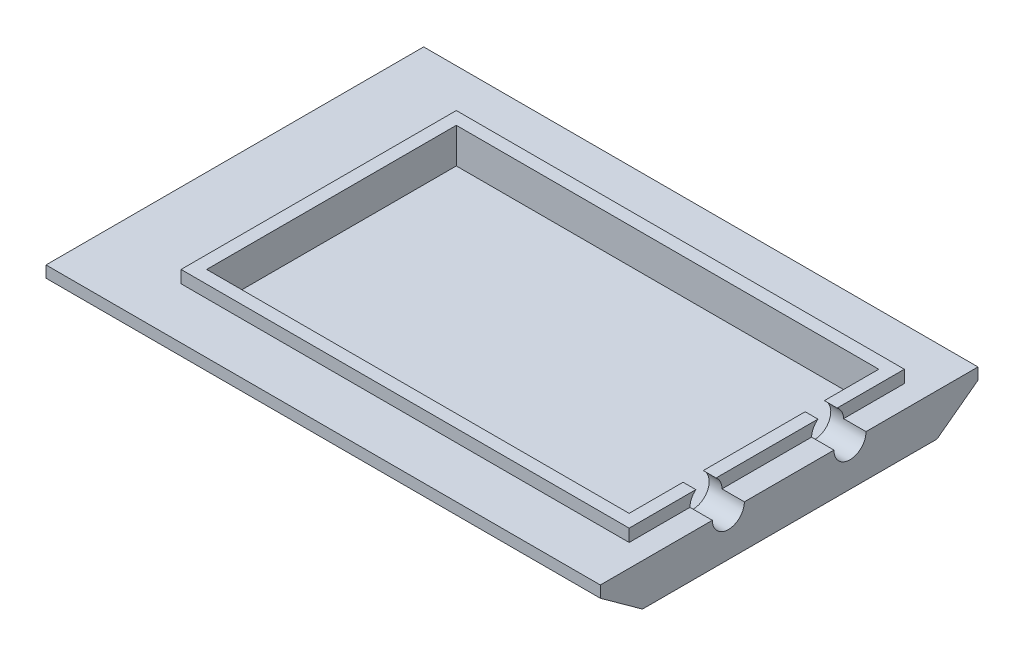
ISO-10303-21;
HEADER;
FILE_DESCRIPTION(('STEP AP214'),'2;1');
FILE_NAME('part.step','',(''),(''),'','','');
FILE_SCHEMA(('AUTOMOTIVE_DESIGN { 1 0 10303 214 1 1 1 1 }'));
ENDSEC;
DATA;
#1=APPLICATION_CONTEXT('core data for automotive mechanical design processes');
#2=APPLICATION_PROTOCOL_DEFINITION('international standard','automotive_design',2000,#1);
#3=PRODUCT_CONTEXT('',#1,'mechanical');
#4=PRODUCT('Part','Part','',(#3));
#5=PRODUCT_RELATED_PRODUCT_CATEGORY('part','',(#4));
#6=PRODUCT_DEFINITION_FORMATION('','',#4);
#7=PRODUCT_DEFINITION_CONTEXT('part definition',#1,'design');
#8=PRODUCT_DEFINITION('design','',#6,#7);
#9=PRODUCT_DEFINITION_SHAPE('','',#8);
#10=(LENGTH_UNIT() NAMED_UNIT(*) SI_UNIT(.MILLI.,.METRE.));
#11=(NAMED_UNIT(*) PLANE_ANGLE_UNIT() SI_UNIT($,.RADIAN.));
#12=(NAMED_UNIT(*) SI_UNIT($,.STERADIAN.) SOLID_ANGLE_UNIT());
#13=UNCERTAINTY_MEASURE_WITH_UNIT(LENGTH_MEASURE(1.E-05),#10,'distance_accuracy_value','');
#14=(GEOMETRIC_REPRESENTATION_CONTEXT(3) GLOBAL_UNCERTAINTY_ASSIGNED_CONTEXT((#13)) GLOBAL_UNIT_ASSIGNED_CONTEXT((#10,
#11,#12)) REPRESENTATION_CONTEXT('',''));
#15=CARTESIAN_POINT('',(0.,0.,0.));
#16=DIRECTION('',(0.,0.,1.));
#17=DIRECTION('',(1.,0.,0.));
#18=AXIS2_PLACEMENT_3D('',#15,#16,#17);
#19=CARTESIAN_POINT('',(0.,21.59,0.));
#20=DIRECTION('',(0.,1.,0.));
#21=DIRECTION('',(0.,0.,1.));
#22=AXIS2_PLACEMENT_3D('',#19,#20,#21);
#23=PLANE('',#22);
#24=DIRECTION('',(1.,0.,0.));
#25=VECTOR('',#24,1.);
#26=CARTESIAN_POINT('',(-19.05,21.59,86.7760235248049));
#27=LINE('',#26,#25);
#28=CARTESIAN_POINT('',(-13.97,21.59,86.7760235248049));
#29=VERTEX_POINT('',#28);
#30=CARTESIAN_POINT('',(-8.89,21.59,86.7760235248049));
#31=VERTEX_POINT('',#30);
#32=EDGE_CURVE('E480',#29,#31,#27,.T.);
#33=ORIENTED_EDGE('',*,*,#32,.F.);
#34=DIRECTION('',(0.,0.,-1.));
#35=VECTOR('',#34,1.);
#36=CARTESIAN_POINT('',(-13.97,21.59,9.11086956521744));
#37=LINE('',#36,#35);
#38=CARTESIAN_POINT('',(-13.97,21.59,108.170869565217));
#39=VERTEX_POINT('',#38);
#40=EDGE_CURVE('E483',#39,#29,#37,.T.);
#41=ORIENTED_EDGE('',*,*,#40,.F.);
#42=DIRECTION('',(1.,0.,0.));
#43=VECTOR('',#42,1.);
#44=CARTESIAN_POINT('',(-181.61,21.59,108.170869565217));
#45=LINE('',#44,#43);
#46=CARTESIAN_POINT('',(-181.61,21.59,108.170869565217));
#47=VERTEX_POINT('',#46);
#48=EDGE_CURVE('E505',#47,#39,#45,.T.);
#49=ORIENTED_EDGE('',*,*,#48,.F.);
#50=DIRECTION('',(0.,0.,1.));
#51=VECTOR('',#50,1.);
#52=CARTESIAN_POINT('',(-181.61,21.59,9.11086956521744));
#53=LINE('',#52,#51);
#54=CARTESIAN_POINT('',(-181.61,21.59,9.11086956521744));
#55=VERTEX_POINT('',#54);
#56=EDGE_CURVE('E509',#55,#47,#53,.T.);
#57=ORIENTED_EDGE('',*,*,#56,.F.);
#58=DIRECTION('',(-1.,0.,0.));
#59=VECTOR('',#58,1.);
#60=CARTESIAN_POINT('',(-181.61,21.59,9.11086956521744));
#61=LINE('',#60,#59);
#62=CARTESIAN_POINT('',(-13.97,21.59,9.11086956521744));
#63=VERTEX_POINT('',#62);
#64=EDGE_CURVE('E512',#63,#55,#61,.T.);
#65=ORIENTED_EDGE('',*,*,#64,.F.);
#66=CARTESIAN_POINT('',(-13.97,21.59,30.7008695652174));
#67=VERTEX_POINT('',#66);
#68=EDGE_CURVE('E499',#67,#63,#37,.T.);
#69=ORIENTED_EDGE('',*,*,#68,.F.);
#70=DIRECTION('',(1.,0.,0.));
#71=VECTOR('',#70,1.);
#72=CARTESIAN_POINT('',(-19.05,21.59,30.7008695652174));
#73=LINE('',#72,#71);
#74=CARTESIAN_POINT('',(-8.89,21.59,30.7008695652174));
#75=VERTEX_POINT('',#74);
#76=EDGE_CURVE('E70',#75,#67,#73,.F.);
#77=ORIENTED_EDGE('',*,*,#76,.F.);
#78=DIRECTION('',(0.,0.,-1.));
#79=VECTOR('',#78,1.);
#80=CARTESIAN_POINT('',(-8.89,21.59,4.03086956521743));
#81=LINE('',#80,#79);
#82=CARTESIAN_POINT('',(-8.89,21.59,4.03086956521743));
#83=VERTEX_POINT('',#82);
#84=EDGE_CURVE('E585',#75,#83,#81,.T.);
#85=ORIENTED_EDGE('',*,*,#84,.T.);
#86=DIRECTION('',(-1.,0.,0.));
#87=VECTOR('',#86,1.);
#88=CARTESIAN_POINT('',(-186.69,21.59,4.03086956521743));
#89=LINE('',#88,#87);
#90=CARTESIAN_POINT('',(-186.69,21.59,4.03086956521743));
#91=VERTEX_POINT('',#90);
#92=EDGE_CURVE('E589',#83,#91,#89,.T.);
#93=ORIENTED_EDGE('',*,*,#92,.T.);
#94=DIRECTION('',(0.,0.,1.));
#95=VECTOR('',#94,1.);
#96=CARTESIAN_POINT('',(-186.69,21.59,4.03086956521743));
#97=LINE('',#96,#95);
#98=CARTESIAN_POINT('',(-186.69,21.59,113.250869565217));
#99=VERTEX_POINT('',#98);
#100=EDGE_CURVE('E681',#91,#99,#97,.T.);
#101=ORIENTED_EDGE('',*,*,#100,.T.);
#102=DIRECTION('',(1.,0.,0.));
#103=VECTOR('',#102,1.);
#104=CARTESIAN_POINT('',(-186.69,21.59,113.250869565217));
#105=LINE('',#104,#103);
#106=CARTESIAN_POINT('',(-8.89000000000001,21.59,113.250869565217));
#107=VERTEX_POINT('',#106);
#108=EDGE_CURVE('E590',#99,#107,#105,.T.);
#109=ORIENTED_EDGE('',*,*,#108,.T.);
#110=EDGE_CURVE('E485',#107,#31,#81,.T.);
#111=ORIENTED_EDGE('',*,*,#110,.T.);
#112=EDGE_LOOP('',(#33,#41,#49,#57,#65,#69,#77,#85,#93,#101,#109,#111));
#113=FACE_BOUND('',#112,.T.);
#114=ADVANCED_FACE('F53',(#113),#23,.T.);
#115=CARTESIAN_POINT('',(0.,16.6624,0.));
#116=DIRECTION('',(0.,1.,0.));
#117=DIRECTION('',(0.,0.,1.));
#118=AXIS2_PLACEMENT_3D('',#115,#116,#117);
#119=PLANE('',#118);
#120=DIRECTION('',(1.,0.,0.));
#121=VECTOR('',#120,1.);
#122=CARTESIAN_POINT('',(-19.05,16.6624,89.1208695652174));
#123=LINE('',#122,#121);
#124=CARTESIAN_POINT('',(-8.89000000000001,16.6624,89.1208695652174));
#125=VERTEX_POINT('',#124);
#126=CARTESIAN_POINT('',(0.,16.6624,89.1208695652174));
#127=VERTEX_POINT('',#126);
#128=EDGE_CURVE('E533',#125,#127,#123,.T.);
#129=ORIENTED_EDGE('',*,*,#128,.F.);
#130=DIRECTION('',(0.,0.,1.));
#131=VECTOR('',#130,1.);
#132=CARTESIAN_POINT('',(-8.89,16.6624,0.));
#133=LINE('',#132,#131);
#134=CARTESIAN_POINT('',(-8.89000000000001,16.6624,113.250869565217));
#135=VERTEX_POINT('',#134);
#136=EDGE_CURVE('E564',#125,#135,#133,.T.);
#137=ORIENTED_EDGE('',*,*,#136,.T.);
#138=DIRECTION('',(-1.,0.,0.));
#139=VECTOR('',#138,1.);
#140=CARTESIAN_POINT('',(0.,16.6624,113.250869565217));
#141=LINE('',#140,#139);
#142=CARTESIAN_POINT('',(-186.69,16.6624,113.250869565217));
#143=VERTEX_POINT('',#142);
#144=EDGE_CURVE('E568',#135,#143,#141,.T.);
#145=ORIENTED_EDGE('',*,*,#144,.T.);
#146=DIRECTION('',(0.,0.,-1.));
#147=VECTOR('',#146,1.);
#148=CARTESIAN_POINT('',(-186.69,16.6624,0.));
#149=LINE('',#148,#147);
#150=CARTESIAN_POINT('',(-186.69,16.6624,4.03086956521743));
#151=VERTEX_POINT('',#150);
#152=EDGE_CURVE('E576',#143,#151,#149,.T.);
#153=ORIENTED_EDGE('',*,*,#152,.T.);
#154=DIRECTION('',(1.,0.,0.));
#155=VECTOR('',#154,1.);
#156=CARTESIAN_POINT('',(0.,16.6624,4.03086956521743));
#157=LINE('',#156,#155);
#158=CARTESIAN_POINT('',(-8.89,16.6624,4.03086956521743));
#159=VERTEX_POINT('',#158);
#160=EDGE_CURVE('E569',#151,#159,#157,.T.);
#161=ORIENTED_EDGE('',*,*,#160,.T.);
#162=CARTESIAN_POINT('',(-8.89,16.6624,28.1626986286405));
#163=VERTEX_POINT('',#162);
#164=EDGE_CURVE('E223',#159,#163,#133,.T.);
#165=ORIENTED_EDGE('',*,*,#164,.T.);
#166=DIRECTION('',(1.,0.,0.));
#167=VECTOR('',#166,1.);
#168=CARTESIAN_POINT('',(-19.05,16.6624,28.1626986286405));
#169=LINE('',#168,#167);
#170=CARTESIAN_POINT('',(0.,16.6624,28.1626986286405));
#171=VERTEX_POINT('',#170);
#172=EDGE_CURVE('E204',#171,#163,#169,.F.);
#173=ORIENTED_EDGE('',*,*,#172,.F.);
#174=DIRECTION('',(0.,0.,-1.));
#175=VECTOR('',#174,1.);
#176=CARTESIAN_POINT('',(0.,16.6624,-16.2891304347826));
#177=LINE('',#176,#175);
#178=CARTESIAN_POINT('',(0.,16.6624,-16.2891304347826));
#179=VERTEX_POINT('',#178);
#180=EDGE_CURVE('E219',#171,#179,#177,.T.);
#181=ORIENTED_EDGE('',*,*,#180,.T.);
#182=DIRECTION('',(-1.,0.,0.));
#183=VECTOR('',#182,1.);
#184=CARTESIAN_POINT('',(-219.964,16.6624,-16.2891304347826));
#185=LINE('',#184,#183);
#186=CARTESIAN_POINT('',(-219.964,16.6624,-16.2891304347826));
#187=VERTEX_POINT('',#186);
#188=EDGE_CURVE('E243',#179,#187,#185,.T.);
#189=ORIENTED_EDGE('',*,*,#188,.T.);
#190=DIRECTION('',(0.,0.,1.));
#191=VECTOR('',#190,1.);
#192=CARTESIAN_POINT('',(-219.964,16.6624,-16.2891304347826));
#193=LINE('',#192,#191);
#194=CARTESIAN_POINT('',(-219.964,16.6624,133.570869565217));
#195=VERTEX_POINT('',#194);
#196=EDGE_CURVE('E238',#187,#195,#193,.T.);
#197=ORIENTED_EDGE('',*,*,#196,.T.);
#198=DIRECTION('',(1.,0.,0.));
#199=VECTOR('',#198,1.);
#200=CARTESIAN_POINT('',(-219.964,16.6624,133.570869565217));
#201=LINE('',#200,#199);
#202=CARTESIAN_POINT('',(0.,16.6624,133.570869565217));
#203=VERTEX_POINT('',#202);
#204=EDGE_CURVE('E233',#195,#203,#201,.T.);
#205=ORIENTED_EDGE('',*,*,#204,.T.);
#206=EDGE_CURVE('E235',#203,#127,#177,.T.);
#207=ORIENTED_EDGE('',*,*,#206,.T.);
#208=EDGE_LOOP('',(#129,#137,#145,#153,#161,#165,#173,#181,#189,#197,#205,#207));
#209=FACE_BOUND('',#208,.T.);
#210=ADVANCED_FACE('F218',(#209),#119,.T.);
#211=CARTESIAN_POINT('',(-8.89,21.59,4.03086956521743));
#212=DIRECTION('',(-1.,0.,0.));
#213=DIRECTION('',(0.,0.,1.));
#214=AXIS2_PLACEMENT_3D('',#211,#212,#213);
#215=PLANE('',#214);
#216=ORIENTED_EDGE('',*,*,#136,.F.);
#217=CARTESIAN_POINT('',(-8.89000000000001,16.6624,82.7708695652174));
#218=DIRECTION('',(-1.,0.,0.));
#219=DIRECTION('',(0.,0.,1.));
#220=AXIS2_PLACEMENT_3D('',#217,#218,#219);
#221=CIRCLE('',#220,6.35);
#222=EDGE_CURVE('E539',#125,#31,#221,.T.);
#223=ORIENTED_EDGE('',*,*,#222,.T.);
#224=ORIENTED_EDGE('',*,*,#110,.F.);
#225=DIRECTION('',(0.,-1.,0.));
#226=VECTOR('',#225,1.);
#227=CARTESIAN_POINT('',(-8.89000000000001,21.59,113.250869565217));
#228=LINE('',#227,#226);
#229=EDGE_CURVE('E603',#107,#135,#228,.T.);
#230=ORIENTED_EDGE('',*,*,#229,.T.);
#231=EDGE_LOOP('',(#216,#223,#224,#230));
#232=FACE_BOUND('',#231,.T.);
#233=ADVANCED_FACE('F438',(#232),#215,.F.);
#234=CARTESIAN_POINT('',(-8.89,21.59,78.7657156056298));
#235=VERTEX_POINT('',#234);
#236=CARTESIAN_POINT('',(-8.89,21.59,38.3208695652174));
#237=VERTEX_POINT('',#236);
#238=EDGE_CURVE('E583',#235,#237,#81,.T.);
#239=ORIENTED_EDGE('',*,*,#238,.F.);
#240=CARTESIAN_POINT('',(-8.89000000000001,16.6624,76.4208695652174));
#241=VERTEX_POINT('',#240);
#242=EDGE_CURVE('E488',#235,#241,#221,.T.);
#243=ORIENTED_EDGE('',*,*,#242,.T.);
#244=CARTESIAN_POINT('',(-8.89,16.6624,40.8590405017944));
#245=VERTEX_POINT('',#244);
#246=EDGE_CURVE('E560',#245,#241,#133,.T.);
#247=ORIENTED_EDGE('',*,*,#246,.F.);
#248=CARTESIAN_POINT('',(-8.89,16.51,34.5108695652174));
#249=DIRECTION('',(-1.,0.,0.));
#250=DIRECTION('',(0.,0.,1.));
#251=AXIS2_PLACEMENT_3D('',#248,#249,#250);
#252=CIRCLE('',#251,6.35);
#253=EDGE_CURVE('E225',#245,#237,#252,.T.);
#254=ORIENTED_EDGE('',*,*,#253,.T.);
#255=EDGE_LOOP('',(#239,#243,#247,#254));
#256=FACE_BOUND('',#255,.T.);
#257=ADVANCED_FACE('F439',(#256),#215,.F.);
#258=DIRECTION('',(1.,0.,0.));
#259=VECTOR('',#258,1.);
#260=CARTESIAN_POINT('',(-19.05,21.59,78.7657156056298));
#261=LINE('',#260,#259);
#262=CARTESIAN_POINT('',(-13.97,21.59,78.7657156056298));
#263=VERTEX_POINT('',#262);
#264=EDGE_CURVE('E77',#235,#263,#261,.F.);
#265=ORIENTED_EDGE('',*,*,#264,.F.);
#266=ORIENTED_EDGE('',*,*,#238,.T.);
#267=DIRECTION('',(1.,0.,0.));
#268=VECTOR('',#267,1.);
#269=CARTESIAN_POINT('',(-19.05,21.59,38.3208695652174));
#270=LINE('',#269,#268);
#271=CARTESIAN_POINT('',(-13.97,21.59,38.3208695652174));
#272=VERTEX_POINT('',#271);
#273=EDGE_CURVE('E550',#272,#237,#270,.T.);
#274=ORIENTED_EDGE('',*,*,#273,.F.);
#275=EDGE_CURVE('E497',#263,#272,#37,.T.);
#276=ORIENTED_EDGE('',*,*,#275,.F.);
#277=EDGE_LOOP('',(#265,#266,#274,#276));
#278=FACE_BOUND('',#277,.T.);
#279=ADVANCED_FACE('F424',(#278),#23,.T.);
#280=DIRECTION('',(1.,0.,0.));
#281=VECTOR('',#280,1.);
#282=CARTESIAN_POINT('',(-19.05,16.6624,76.4208695652174));
#283=LINE('',#282,#281);
#284=CARTESIAN_POINT('',(0.,16.6624,76.4208695652174));
#285=VERTEX_POINT('',#284);
#286=EDGE_CURVE('E536',#285,#241,#283,.F.);
#287=ORIENTED_EDGE('',*,*,#286,.F.);
#288=CARTESIAN_POINT('',(0.,16.6624,40.8590405017944));
#289=VERTEX_POINT('',#288);
#290=EDGE_CURVE('E232',#285,#289,#177,.T.);
#291=ORIENTED_EDGE('',*,*,#290,.T.);
#292=DIRECTION('',(1.,0.,0.));
#293=VECTOR('',#292,1.);
#294=CARTESIAN_POINT('',(-19.05,16.6624,40.8590405017944));
#295=LINE('',#294,#293);
#296=EDGE_CURVE('E207',#245,#289,#295,.T.);
#297=ORIENTED_EDGE('',*,*,#296,.F.);
#298=ORIENTED_EDGE('',*,*,#246,.T.);
#299=EDGE_LOOP('',(#287,#291,#297,#298));
#300=FACE_BOUND('',#299,.T.);
#301=ADVANCED_FACE('F421',(#300),#119,.T.);
#302=CARTESIAN_POINT('',(0.,0.,0.));
#303=DIRECTION('',(0.,1.,0.));
#304=DIRECTION('',(0.,0.,1.));
#305=AXIS2_PLACEMENT_3D('',#302,#303,#304);
#306=PLANE('',#305);
#307=DIRECTION('',(0.,0.,1.));
#308=VECTOR('',#307,1.);
#309=CARTESIAN_POINT('',(-190.5,0.,0.));
#310=LINE('',#309,#308);
#311=CARTESIAN_POINT('',(-190.5,0.,0.));
#312=VERTEX_POINT('',#311);
#313=CARTESIAN_POINT('',(-190.5,0.,116.84));
#314=VERTEX_POINT('',#313);
#315=EDGE_CURVE('E321',#312,#314,#310,.T.);
#316=ORIENTED_EDGE('',*,*,#315,.F.);
#317=DIRECTION('',(-1.,0.,0.));
#318=VECTOR('',#317,1.);
#319=CARTESIAN_POINT('',(-190.5,0.,0.));
#320=LINE('',#319,#318);
#321=CARTESIAN_POINT('',(0.,0.,0.));
#322=VERTEX_POINT('',#321);
#323=EDGE_CURVE('E635',#322,#312,#320,.T.);
#324=ORIENTED_EDGE('',*,*,#323,.F.);
#325=DIRECTION('',(0.,0.,-1.));
#326=VECTOR('',#325,1.);
#327=CARTESIAN_POINT('',(0.,0.,0.));
#328=LINE('',#327,#326);
#329=CARTESIAN_POINT('',(0.,0.,116.84));
#330=VERTEX_POINT('',#329);
#331=EDGE_CURVE('E294',#330,#322,#328,.T.);
#332=ORIENTED_EDGE('',*,*,#331,.F.);
#333=DIRECTION('',(1.,0.,0.));
#334=VECTOR('',#333,1.);
#335=CARTESIAN_POINT('',(-190.5,0.,116.84));
#336=LINE('',#335,#334);
#337=EDGE_CURVE('E307',#314,#330,#336,.T.);
#338=ORIENTED_EDGE('',*,*,#337,.F.);
#339=EDGE_LOOP('',(#316,#324,#332,#338));
#340=FACE_BOUND('',#339,.T.);
#341=ADVANCED_FACE('F55',(#340),#306,.F.);
#342=CARTESIAN_POINT('',(-27.4541323617712,-66.9050284446525,0.));
#343=DIRECTION('',(-0.379626369443367,-0.92513989192081,0.));
#344=DIRECTION('',(0.92513989192081,-0.379626369443367,0.));
#345=AXIS2_PLACEMENT_3D('',#342,#343,#344);
#346=PLANE('',#345);
#347=DIRECTION('',(0.823659401549222,-0.337984375118474,0.455358927018403));
#348=VECTOR('',#347,1.);
#349=CARTESIAN_POINT('',(-219.964,12.0904,-16.2891304347826));
#350=LINE('',#349,#348);
#351=CARTESIAN_POINT('',(-219.964,12.0904,-16.2891304347826));
#352=VERTEX_POINT('',#351);
#353=EDGE_CURVE('E357',#352,#312,#350,.T.);
#354=ORIENTED_EDGE('',*,*,#353,.T.);
#355=ORIENTED_EDGE('',*,*,#315,.T.);
#356=DIRECTION('',(0.819004837822664,-0.33607439896861,-0.465064591192406));
#357=VECTOR('',#356,1.);
#358=CARTESIAN_POINT('',(-219.964,12.0904,133.570869565217));
#359=LINE('',#358,#357);
#360=CARTESIAN_POINT('',(-219.964,12.0904,133.570869565217));
#361=VERTEX_POINT('',#360);
#362=EDGE_CURVE('E354',#361,#314,#359,.T.);
#363=ORIENTED_EDGE('',*,*,#362,.F.);
#364=DIRECTION('',(0.,0.,1.));
#365=VECTOR('',#364,1.);
#366=CARTESIAN_POINT('',(-219.964,12.0904,-16.2891304347826));
#367=LINE('',#366,#365);
#368=EDGE_CURVE('E351',#352,#361,#367,.T.);
#369=ORIENTED_EDGE('',*,*,#368,.F.);
#370=EDGE_LOOP('',(#354,#355,#363,#369));
#371=FACE_BOUND('',#370,.T.);
#372=ADVANCED_FACE('F327',(#371),#346,.T.);
#373=CARTESIAN_POINT('',(0.,-55.4676073759251,40.0831264390513));
#374=DIRECTION('',(0.,0.810518373573741,-0.585713211477578));
#375=DIRECTION('',(0.,0.585713211477578,0.810518373573741));
#376=AXIS2_PLACEMENT_3D('',#373,#374,#375);
#377=PLANE('',#376);
#378=ORIENTED_EDGE('',*,*,#362,.T.);
#379=ORIENTED_EDGE('',*,*,#337,.T.);
#380=DIRECTION('',(0.,-0.585713211477578,-0.810518373573741));
#381=VECTOR('',#380,1.);
#382=CARTESIAN_POINT('',(0.,12.0904,133.570869565217));
#383=LINE('',#382,#381);
#384=CARTESIAN_POINT('',(0.,12.0904,133.570869565217));
#385=VERTEX_POINT('',#384);
#386=EDGE_CURVE('E371',#385,#330,#383,.T.);
#387=ORIENTED_EDGE('',*,*,#386,.F.);
#388=DIRECTION('',(1.,0.,0.));
#389=VECTOR('',#388,1.);
#390=CARTESIAN_POINT('',(-219.964,12.0904,133.570869565217));
#391=LINE('',#390,#389);
#392=EDGE_CURVE('E368',#361,#385,#391,.T.);
#393=ORIENTED_EDGE('',*,*,#392,.F.);
#394=EDGE_LOOP('',(#378,#379,#387,#393));
#395=FACE_BOUND('',#394,.T.);
#396=ADVANCED_FACE('F274',(#395),#377,.F.);
#397=CARTESIAN_POINT('',(0.,0.,0.));
#398=DIRECTION('',(0.,-0.802982046011134,-0.596003216252876));
#399=DIRECTION('',(0.,0.596003216252876,-0.802982046011134));
#400=AXIS2_PLACEMENT_3D('',#397,#398,#399);
#401=PLANE('',#400);
#402=DIRECTION('',(0.,-0.596003216252876,0.802982046011134));
#403=VECTOR('',#402,1.);
#404=CARTESIAN_POINT('',(0.,12.0904,-16.2891304347826));
#405=LINE('',#404,#403);
#406=CARTESIAN_POINT('',(0.,12.0904,-16.2891304347826));
#407=VERTEX_POINT('',#406);
#408=EDGE_CURVE('E263',#407,#322,#405,.T.);
#409=ORIENTED_EDGE('',*,*,#408,.T.);
#410=ORIENTED_EDGE('',*,*,#323,.T.);
#411=ORIENTED_EDGE('',*,*,#353,.F.);
#412=DIRECTION('',(-1.,0.,0.));
#413=VECTOR('',#412,1.);
#414=CARTESIAN_POINT('',(-219.964,12.0904,-16.2891304347826));
#415=LINE('',#414,#413);
#416=EDGE_CURVE('E258',#407,#352,#415,.T.);
#417=ORIENTED_EDGE('',*,*,#416,.F.);
#418=EDGE_LOOP('',(#409,#410,#411,#417));
#419=FACE_BOUND('',#418,.T.);
#420=ADVANCED_FACE('F265',(#419),#401,.T.);
#421=CARTESIAN_POINT('',(0.,0.,0.));
#422=DIRECTION('',(-1.,0.,0.));
#423=DIRECTION('',(0.,-1.,0.));
#424=AXIS2_PLACEMENT_3D('',#421,#422,#423);
#425=PLANE('',#424);
#426=ORIENTED_EDGE('',*,*,#290,.F.);
#427=CARTESIAN_POINT('',(0.,16.6624,82.7708695652174));
#428=DIRECTION('',(1.,0.,0.));
#429=DIRECTION('',(0.,0.,-1.));
#430=AXIS2_PLACEMENT_3D('',#427,#428,#429);
#431=CIRCLE('',#430,6.35);
#432=EDGE_CURVE('E213',#127,#285,#431,.T.);
#433=ORIENTED_EDGE('',*,*,#432,.F.);
#434=ORIENTED_EDGE('',*,*,#206,.F.);
#435=DIRECTION('',(0.,-1.,0.));
#436=VECTOR('',#435,1.);
#437=CARTESIAN_POINT('',(0.,16.6624,133.570869565217));
#438=LINE('',#437,#436);
#439=EDGE_CURVE('E391',#203,#385,#438,.T.);
#440=ORIENTED_EDGE('',*,*,#439,.T.);
#441=ORIENTED_EDGE('',*,*,#386,.T.);
#442=ORIENTED_EDGE('',*,*,#331,.T.);
#443=ORIENTED_EDGE('',*,*,#408,.F.);
#444=DIRECTION('',(0.,-1.,0.));
#445=VECTOR('',#444,1.);
#446=CARTESIAN_POINT('',(0.,16.6624,-16.2891304347826));
#447=LINE('',#446,#445);
#448=EDGE_CURVE('E229',#179,#407,#447,.T.);
#449=ORIENTED_EDGE('',*,*,#448,.F.);
#450=ORIENTED_EDGE('',*,*,#180,.F.);
#451=CARTESIAN_POINT('',(0.,16.51,34.5108695652174));
#452=DIRECTION('',(1.,0.,0.));
#453=DIRECTION('',(0.,0.,-1.));
#454=AXIS2_PLACEMENT_3D('',#451,#452,#453);
#455=CIRCLE('',#454,6.35);
#456=EDGE_CURVE('E201',#289,#171,#455,.T.);
#457=ORIENTED_EDGE('',*,*,#456,.F.);
#458=EDGE_LOOP('',(#426,#433,#434,#440,#441,#442,#443,#449,#450,#457));
#459=FACE_BOUND('',#458,.T.);
#460=ADVANCED_FACE('F227',(#459),#425,.F.);
#461=CARTESIAN_POINT('',(-219.964,16.6624,-16.2891304347826));
#462=DIRECTION('',(1.,0.,0.));
#463=DIRECTION('',(0.,0.,-1.));
#464=AXIS2_PLACEMENT_3D('',#461,#462,#463);
#465=PLANE('',#464);
#466=ORIENTED_EDGE('',*,*,#368,.T.);
#467=DIRECTION('',(0.,-1.,0.));
#468=VECTOR('',#467,1.);
#469=CARTESIAN_POINT('',(-219.964,16.6624,133.570869565217));
#470=LINE('',#469,#468);
#471=EDGE_CURVE('E397',#195,#361,#470,.T.);
#472=ORIENTED_EDGE('',*,*,#471,.F.);
#473=ORIENTED_EDGE('',*,*,#196,.F.);
#474=DIRECTION('',(0.,-1.,0.));
#475=VECTOR('',#474,1.);
#476=CARTESIAN_POINT('',(-219.964,16.6624,-16.2891304347826));
#477=LINE('',#476,#475);
#478=EDGE_CURVE('E246',#187,#352,#477,.T.);
#479=ORIENTED_EDGE('',*,*,#478,.T.);
#480=EDGE_LOOP('',(#466,#472,#473,#479));
#481=FACE_BOUND('',#480,.T.);
#482=ADVANCED_FACE('F336',(#481),#465,.F.);
#483=CARTESIAN_POINT('',(-219.964,16.6624,133.570869565217));
#484=DIRECTION('',(0.,0.,-1.));
#485=DIRECTION('',(-1.,0.,0.));
#486=AXIS2_PLACEMENT_3D('',#483,#484,#485);
#487=PLANE('',#486);
#488=ORIENTED_EDGE('',*,*,#392,.T.);
#489=ORIENTED_EDGE('',*,*,#439,.F.);
#490=ORIENTED_EDGE('',*,*,#204,.F.);
#491=ORIENTED_EDGE('',*,*,#471,.T.);
#492=EDGE_LOOP('',(#488,#489,#490,#491));
#493=FACE_BOUND('',#492,.T.);
#494=ADVANCED_FACE('F408',(#493),#487,.F.);
#495=CARTESIAN_POINT('',(-219.964,16.6624,-16.2891304347826));
#496=DIRECTION('',(0.,0.,1.));
#497=DIRECTION('',(1.,0.,0.));
#498=AXIS2_PLACEMENT_3D('',#495,#496,#497);
#499=PLANE('',#498);
#500=ORIENTED_EDGE('',*,*,#416,.T.);
#501=ORIENTED_EDGE('',*,*,#478,.F.);
#502=ORIENTED_EDGE('',*,*,#188,.F.);
#503=ORIENTED_EDGE('',*,*,#448,.T.);
#504=EDGE_LOOP('',(#500,#501,#502,#503));
#505=FACE_BOUND('',#504,.T.);
#506=ADVANCED_FACE('F416',(#505),#499,.F.);
#507=CARTESIAN_POINT('',(-186.69,21.59,4.03086956521743));
#508=DIRECTION('',(1.,0.,0.));
#509=DIRECTION('',(0.,0.,-1.));
#510=AXIS2_PLACEMENT_3D('',#507,#508,#509);
#511=PLANE('',#510);
#512=ORIENTED_EDGE('',*,*,#152,.F.);
#513=DIRECTION('',(0.,-1.,0.));
#514=VECTOR('',#513,1.);
#515=CARTESIAN_POINT('',(-186.69,21.59,113.250869565217));
#516=LINE('',#515,#514);
#517=EDGE_CURVE('E607',#99,#143,#516,.T.);
#518=ORIENTED_EDGE('',*,*,#517,.F.);
#519=ORIENTED_EDGE('',*,*,#100,.F.);
#520=DIRECTION('',(0.,-1.,0.));
#521=VECTOR('',#520,1.);
#522=CARTESIAN_POINT('',(-186.69,21.59,4.03086956521743));
#523=LINE('',#522,#521);
#524=EDGE_CURVE('E596',#91,#151,#523,.T.);
#525=ORIENTED_EDGE('',*,*,#524,.T.);
#526=EDGE_LOOP('',(#512,#518,#519,#525));
#527=FACE_BOUND('',#526,.T.);
#528=ADVANCED_FACE('F420',(#527),#511,.F.);
#529=CARTESIAN_POINT('',(-186.69,21.59,113.250869565217));
#530=DIRECTION('',(0.,0.,-1.));
#531=DIRECTION('',(-1.,0.,0.));
#532=AXIS2_PLACEMENT_3D('',#529,#530,#531);
#533=PLANE('',#532);
#534=ORIENTED_EDGE('',*,*,#144,.F.);
#535=ORIENTED_EDGE('',*,*,#229,.F.);
#536=ORIENTED_EDGE('',*,*,#108,.F.);
#537=ORIENTED_EDGE('',*,*,#517,.T.);
#538=EDGE_LOOP('',(#534,#535,#536,#537));
#539=FACE_BOUND('',#538,.T.);
#540=ADVANCED_FACE('F428',(#539),#533,.F.);
#541=ORIENTED_EDGE('',*,*,#84,.F.);
#542=EDGE_CURVE('E547',#75,#163,#252,.T.);
#543=ORIENTED_EDGE('',*,*,#542,.T.);
#544=ORIENTED_EDGE('',*,*,#164,.F.);
#545=DIRECTION('',(0.,-1.,0.));
#546=VECTOR('',#545,1.);
#547=CARTESIAN_POINT('',(-8.89,21.59,4.03086956521743));
#548=LINE('',#547,#546);
#549=EDGE_CURVE('E600',#83,#159,#548,.T.);
#550=ORIENTED_EDGE('',*,*,#549,.F.);
#551=EDGE_LOOP('',(#541,#543,#544,#550));
#552=FACE_BOUND('',#551,.T.);
#553=ADVANCED_FACE('F432',(#552),#215,.F.);
#554=CARTESIAN_POINT('',(-186.69,21.59,4.03086956521743));
#555=DIRECTION('',(0.,0.,1.));
#556=DIRECTION('',(1.,0.,0.));
#557=AXIS2_PLACEMENT_3D('',#554,#555,#556);
#558=PLANE('',#557);
#559=ORIENTED_EDGE('',*,*,#160,.F.);
#560=ORIENTED_EDGE('',*,*,#524,.F.);
#561=ORIENTED_EDGE('',*,*,#92,.F.);
#562=ORIENTED_EDGE('',*,*,#549,.T.);
#563=EDGE_LOOP('',(#559,#560,#561,#562));
#564=FACE_BOUND('',#563,.T.);
#565=ADVANCED_FACE('F436',(#564),#558,.F.);
#566=CARTESIAN_POINT('',(-181.61,21.59,9.11086956521744));
#567=DIRECTION('',(0.,0.,1.));
#568=DIRECTION('',(1.,0.,0.));
#569=AXIS2_PLACEMENT_3D('',#566,#567,#568);
#570=PLANE('',#569);
#571=DIRECTION('',(0.,-1.,0.));
#572=VECTOR('',#571,1.);
#573=CARTESIAN_POINT('',(-181.61,21.59,9.11086956521744));
#574=LINE('',#573,#572);
#575=CARTESIAN_POINT('',(-181.61,7.62,9.11086956521744));
#576=VERTEX_POINT('',#575);
#577=EDGE_CURVE('E683',#55,#576,#574,.T.);
#578=ORIENTED_EDGE('',*,*,#577,.T.);
#579=DIRECTION('',(-1.,0.,0.));
#580=VECTOR('',#579,1.);
#581=CARTESIAN_POINT('',(-181.61,7.62,9.11086956521744));
#582=LINE('',#581,#580);
#583=CARTESIAN_POINT('',(-13.97,7.62,9.11086956521744));
#584=VERTEX_POINT('',#583);
#585=EDGE_CURVE('E529',#584,#576,#582,.T.);
#586=ORIENTED_EDGE('',*,*,#585,.F.);
#587=DIRECTION('',(0.,-1.,0.));
#588=VECTOR('',#587,1.);
#589=CARTESIAN_POINT('',(-13.97,21.59,9.11086956521744));
#590=LINE('',#589,#588);
#591=EDGE_CURVE('E496',#63,#584,#590,.T.);
#592=ORIENTED_EDGE('',*,*,#591,.F.);
#593=ORIENTED_EDGE('',*,*,#64,.T.);
#594=EDGE_LOOP('',(#578,#586,#592,#593));
#595=FACE_BOUND('',#594,.T.);
#596=ADVANCED_FACE('F442',(#595),#570,.T.);
#597=CARTESIAN_POINT('',(-181.61,21.59,9.11086956521744));
#598=DIRECTION('',(1.,0.,0.));
#599=DIRECTION('',(0.,0.,-1.));
#600=AXIS2_PLACEMENT_3D('',#597,#598,#599);
#601=PLANE('',#600);
#602=DIRECTION('',(0.,-1.,0.));
#603=VECTOR('',#602,1.);
#604=CARTESIAN_POINT('',(-181.61,21.59,108.170869565217));
#605=LINE('',#604,#603);
#606=CARTESIAN_POINT('',(-181.61,7.62,108.170869565217));
#607=VERTEX_POINT('',#606);
#608=EDGE_CURVE('E686',#47,#607,#605,.T.);
#609=ORIENTED_EDGE('',*,*,#608,.T.);
#610=DIRECTION('',(0.,0.,1.));
#611=VECTOR('',#610,1.);
#612=CARTESIAN_POINT('',(-181.61,7.62,9.11086956521744));
#613=LINE('',#612,#611);
#614=EDGE_CURVE('E525',#576,#607,#613,.T.);
#615=ORIENTED_EDGE('',*,*,#614,.F.);
#616=ORIENTED_EDGE('',*,*,#577,.F.);
#617=ORIENTED_EDGE('',*,*,#56,.T.);
#618=EDGE_LOOP('',(#609,#615,#616,#617));
#619=FACE_BOUND('',#618,.T.);
#620=ADVANCED_FACE('F449',(#619),#601,.T.);
#621=CARTESIAN_POINT('',(-181.61,21.59,108.170869565217));
#622=DIRECTION('',(0.,0.,-1.));
#623=DIRECTION('',(-1.,0.,0.));
#624=AXIS2_PLACEMENT_3D('',#621,#622,#623);
#625=PLANE('',#624);
#626=DIRECTION('',(0.,-1.,0.));
#627=VECTOR('',#626,1.);
#628=CARTESIAN_POINT('',(-13.97,21.59,108.170869565217));
#629=LINE('',#628,#627);
#630=CARTESIAN_POINT('',(-13.97,7.62,108.170869565217));
#631=VERTEX_POINT('',#630);
#632=EDGE_CURVE('E493',#39,#631,#629,.T.);
#633=ORIENTED_EDGE('',*,*,#632,.T.);
#634=DIRECTION('',(1.,0.,0.));
#635=VECTOR('',#634,1.);
#636=CARTESIAN_POINT('',(-181.61,7.62,108.170869565217));
#637=LINE('',#636,#635);
#638=EDGE_CURVE('E521',#607,#631,#637,.T.);
#639=ORIENTED_EDGE('',*,*,#638,.F.);
#640=ORIENTED_EDGE('',*,*,#608,.F.);
#641=ORIENTED_EDGE('',*,*,#48,.T.);
#642=EDGE_LOOP('',(#633,#639,#640,#641));
#643=FACE_BOUND('',#642,.T.);
#644=ADVANCED_FACE('F453',(#643),#625,.T.);
#645=CARTESIAN_POINT('',(-13.97,21.59,9.11086956521744));
#646=DIRECTION('',(-1.,0.,0.));
#647=DIRECTION('',(0.,0.,1.));
#648=AXIS2_PLACEMENT_3D('',#645,#646,#647);
#649=PLANE('',#648);
#650=CARTESIAN_POINT('',(-13.97,16.6624,82.7708695652174));
#651=DIRECTION('',(-1.,0.,0.));
#652=DIRECTION('',(0.,0.,1.));
#653=AXIS2_PLACEMENT_3D('',#650,#651,#652);
#654=CIRCLE('',#653,6.35);
#655=EDGE_CURVE('E12',#263,#29,#654,.T.);
#656=ORIENTED_EDGE('',*,*,#655,.F.);
#657=ORIENTED_EDGE('',*,*,#275,.T.);
#658=CARTESIAN_POINT('',(-13.97,16.51,34.5108695652174));
#659=DIRECTION('',(-1.,0.,0.));
#660=DIRECTION('',(0.,0.,1.));
#661=AXIS2_PLACEMENT_3D('',#658,#659,#660);
#662=CIRCLE('',#661,6.35);
#663=EDGE_CURVE('E63',#67,#272,#662,.T.);
#664=ORIENTED_EDGE('',*,*,#663,.F.);
#665=ORIENTED_EDGE('',*,*,#68,.T.);
#666=ORIENTED_EDGE('',*,*,#591,.T.);
#667=DIRECTION('',(0.,0.,-1.));
#668=VECTOR('',#667,1.);
#669=CARTESIAN_POINT('',(-13.97,7.62,9.11086956521744));
#670=LINE('',#669,#668);
#671=EDGE_CURVE('E517',#631,#584,#670,.T.);
#672=ORIENTED_EDGE('',*,*,#671,.F.);
#673=ORIENTED_EDGE('',*,*,#632,.F.);
#674=ORIENTED_EDGE('',*,*,#40,.T.);
#675=EDGE_LOOP('',(#656,#657,#664,#665,#666,#672,#673,#674));
#676=FACE_BOUND('',#675,.T.);
#677=ADVANCED_FACE('F457',(#676),#649,.T.);
#678=CARTESIAN_POINT('',(0.,7.62,0.));
#679=DIRECTION('',(0.,-1.,0.));
#680=DIRECTION('',(0.,0.,-1.));
#681=AXIS2_PLACEMENT_3D('',#678,#679,#680);
#682=PLANE('',#681);
#683=ORIENTED_EDGE('',*,*,#585,.T.);
#684=ORIENTED_EDGE('',*,*,#614,.T.);
#685=ORIENTED_EDGE('',*,*,#638,.T.);
#686=ORIENTED_EDGE('',*,*,#671,.T.);
#687=EDGE_LOOP('',(#683,#684,#685,#686));
#688=FACE_BOUND('',#687,.T.);
#689=ADVANCED_FACE('F461',(#688),#682,.F.);
#690=CARTESIAN_POINT('',(-19.05,16.51,34.5108695652174));
#691=DIRECTION('',(1.,0.,0.));
#692=DIRECTION('',(0.,0.,-1.));
#693=AXIS2_PLACEMENT_3D('',#690,#691,#692);
#694=CYLINDRICAL_SURFACE('',#693,6.35);
#695=ORIENTED_EDGE('',*,*,#296,.T.);
#696=ORIENTED_EDGE('',*,*,#456,.T.);
#697=ORIENTED_EDGE('',*,*,#172,.T.);
#698=ORIENTED_EDGE('',*,*,#542,.F.);
#699=ORIENTED_EDGE('',*,*,#76,.T.);
#700=ORIENTED_EDGE('',*,*,#663,.T.);
#701=ORIENTED_EDGE('',*,*,#273,.T.);
#702=ORIENTED_EDGE('',*,*,#253,.F.);
#703=EDGE_LOOP('',(#695,#696,#697,#698,#699,#700,#701,#702));
#704=FACE_BOUND('',#703,.T.);
#705=ADVANCED_FACE('F203',(#704),#694,.F.);
#706=CARTESIAN_POINT('',(-19.05,16.6624,82.7708695652174));
#707=DIRECTION('',(1.,0.,0.));
#708=DIRECTION('',(0.,0.,-1.));
#709=AXIS2_PLACEMENT_3D('',#706,#707,#708);
#710=CYLINDRICAL_SURFACE('',#709,6.35);
#711=ORIENTED_EDGE('',*,*,#128,.T.);
#712=ORIENTED_EDGE('',*,*,#432,.T.);
#713=ORIENTED_EDGE('',*,*,#286,.T.);
#714=ORIENTED_EDGE('',*,*,#242,.F.);
#715=ORIENTED_EDGE('',*,*,#264,.T.);
#716=ORIENTED_EDGE('',*,*,#655,.T.);
#717=ORIENTED_EDGE('',*,*,#32,.T.);
#718=ORIENTED_EDGE('',*,*,#222,.F.);
#719=EDGE_LOOP('',(#711,#712,#713,#714,#715,#716,#717,#718));
#720=FACE_BOUND('',#719,.T.);
#721=ADVANCED_FACE('F468',(#720),#710,.F.);
#722=CLOSED_SHELL('',(#114,#210,#233,#257,#279,#301,#341,#372,#396,#420,#460,#482,#494,#506,
#528,#540,#553,#565,#596,#620,#644,#677,#689,#705,#721));
#723=MANIFOLD_SOLID_BREP('B2',#722);
#724=ADVANCED_BREP_SHAPE_REPRESENTATION('',(#18,#723),#14);
#725=SHAPE_DEFINITION_REPRESENTATION(#9,#724);
ENDSEC;
END-ISO-10303-21;
